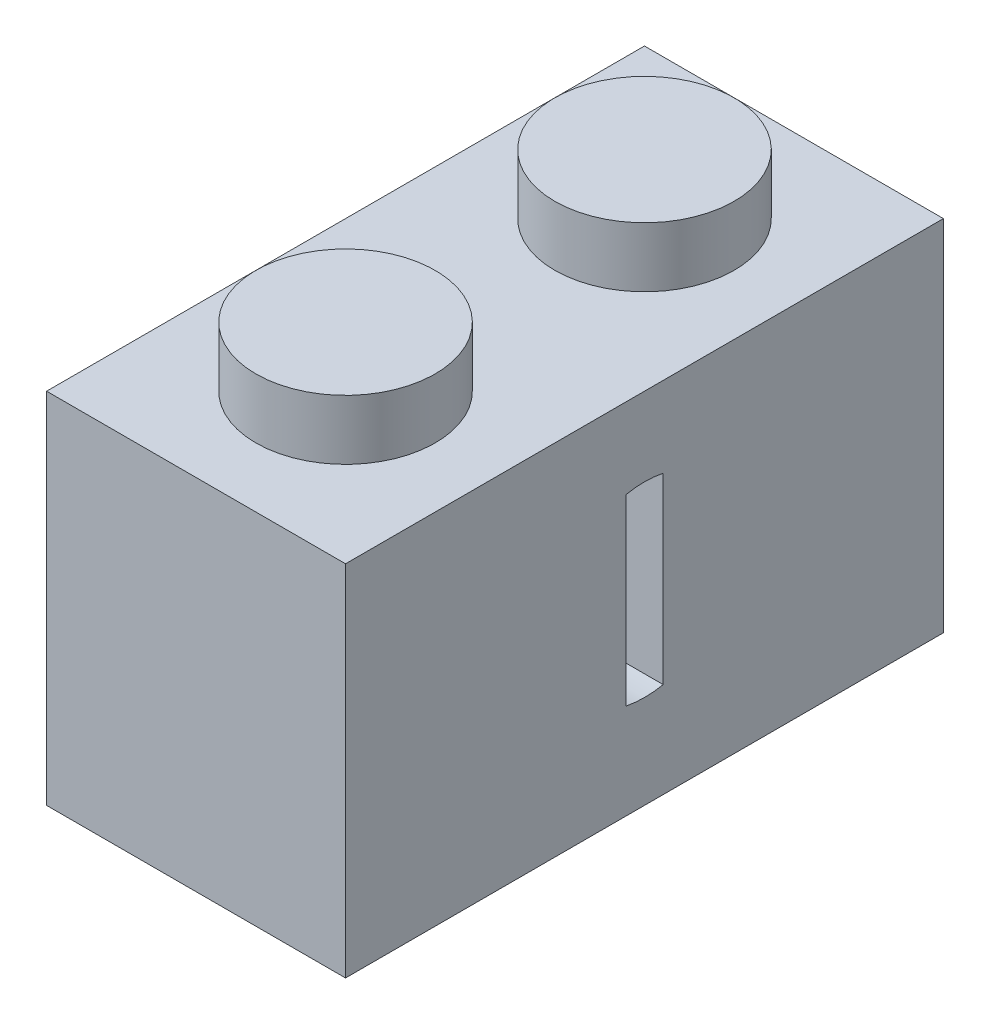
ISO-10303-21;
HEADER;
FILE_DESCRIPTION(('STEP AP214'),'2;1');
FILE_NAME('part.step','',(''),(''),'','','');
FILE_SCHEMA(('AUTOMOTIVE_DESIGN { 1 0 10303 214 1 1 1 1 }'));
ENDSEC;
DATA;
#1=APPLICATION_CONTEXT('core data for automotive mechanical design processes');
#2=APPLICATION_PROTOCOL_DEFINITION('international standard','automotive_design',2000,#1);
#3=PRODUCT_CONTEXT('',#1,'mechanical');
#4=PRODUCT('Part','Part','',(#3));
#5=PRODUCT_RELATED_PRODUCT_CATEGORY('part','',(#4));
#6=PRODUCT_DEFINITION_FORMATION('','',#4);
#7=PRODUCT_DEFINITION_CONTEXT('part definition',#1,'design');
#8=PRODUCT_DEFINITION('design','',#6,#7);
#9=PRODUCT_DEFINITION_SHAPE('','',#8);
#10=(LENGTH_UNIT() NAMED_UNIT(*) SI_UNIT(.MILLI.,.METRE.));
#11=(NAMED_UNIT(*) PLANE_ANGLE_UNIT() SI_UNIT($,.RADIAN.));
#12=(NAMED_UNIT(*) SI_UNIT($,.STERADIAN.) SOLID_ANGLE_UNIT());
#13=UNCERTAINTY_MEASURE_WITH_UNIT(LENGTH_MEASURE(1.E-05),#10,'distance_accuracy_value','');
#14=(GEOMETRIC_REPRESENTATION_CONTEXT(3) GLOBAL_UNCERTAINTY_ASSIGNED_CONTEXT((#13)) GLOBAL_UNIT_ASSIGNED_CONTEXT((#10,
#11,#12)) REPRESENTATION_CONTEXT('',''));
#15=CARTESIAN_POINT('',(0.,0.,0.));
#16=DIRECTION('',(0.,0.,1.));
#17=DIRECTION('',(1.,0.,0.));
#18=AXIS2_PLACEMENT_3D('',#15,#16,#17);
#19=CARTESIAN_POINT('',(3.5,5.,8.));
#20=DIRECTION('',(-1.,0.,0.));
#21=DIRECTION('',(0.,-1.,0.));
#22=AXIS2_PLACEMENT_3D('',#19,#20,#21);
#23=CYLINDRICAL_SURFACE('',#22,2.5);
#24=CARTESIAN_POINT('',(3.5,5.,8.));
#25=DIRECTION('',(-1.,0.,0.));
#26=DIRECTION('',(0.,-1.,0.));
#27=AXIS2_PLACEMENT_3D('',#24,#25,#26);
#28=CIRCLE('',#27,2.5);
#29=CARTESIAN_POINT('',(3.5,2.55051025721683,8.5));
#30=VERTEX_POINT('',#29);
#31=CARTESIAN_POINT('',(3.5,7.44948974278318,8.5));
#32=VERTEX_POINT('',#31);
#33=EDGE_CURVE('E215',#30,#32,#28,.T.);
#34=ORIENTED_EDGE('',*,*,#33,.F.);
#35=DIRECTION('',(-1.,0.,0.));
#36=VECTOR('',#35,1.);
#37=CARTESIAN_POINT('',(13.0990195135928,2.55051025721683,8.5));
#38=LINE('',#37,#36);
#39=CARTESIAN_POINT('',(8.,2.55051025721683,8.5));
#40=VERTEX_POINT('',#39);
#41=EDGE_CURVE('E206',#40,#30,#38,.T.);
#42=ORIENTED_EDGE('',*,*,#41,.F.);
#43=CARTESIAN_POINT('',(8.,5.,8.));
#44=DIRECTION('',(1.,0.,0.));
#45=DIRECTION('',(0.,1.,0.));
#46=AXIS2_PLACEMENT_3D('',#43,#44,#45);
#47=CIRCLE('',#46,2.5);
#48=CARTESIAN_POINT('',(8.,2.55051025721683,7.5));
#49=VERTEX_POINT('',#48);
#50=EDGE_CURVE('E203',#49,#40,#47,.F.);
#51=ORIENTED_EDGE('',*,*,#50,.F.);
#52=DIRECTION('',(-1.,0.,0.));
#53=VECTOR('',#52,1.);
#54=CARTESIAN_POINT('',(13.0990195135928,2.55051025721683,7.5));
#55=LINE('',#54,#53);
#56=CARTESIAN_POINT('',(3.5,2.55051025721683,7.5));
#57=VERTEX_POINT('',#56);
#58=EDGE_CURVE('E207',#49,#57,#55,.T.);
#59=ORIENTED_EDGE('',*,*,#58,.T.);
#60=CARTESIAN_POINT('',(3.5,7.44948974278318,7.5));
#61=VERTEX_POINT('',#60);
#62=EDGE_CURVE('E198',#61,#57,#28,.T.);
#63=ORIENTED_EDGE('',*,*,#62,.F.);
#64=DIRECTION('',(-1.,0.,0.));
#65=VECTOR('',#64,1.);
#66=CARTESIAN_POINT('',(13.0990195135928,7.44948974278318,7.5));
#67=LINE('',#66,#65);
#68=CARTESIAN_POINT('',(8.,7.44948974278318,7.5));
#69=VERTEX_POINT('',#68);
#70=EDGE_CURVE('E60',#69,#61,#67,.T.);
#71=ORIENTED_EDGE('',*,*,#70,.F.);
#72=CARTESIAN_POINT('',(8.,5.,8.));
#73=DIRECTION('',(1.,0.,0.));
#74=DIRECTION('',(0.,1.,0.));
#75=AXIS2_PLACEMENT_3D('',#72,#73,#74);
#76=CIRCLE('',#75,2.5);
#77=CARTESIAN_POINT('',(8.,7.44948974278318,8.5));
#78=VERTEX_POINT('',#77);
#79=EDGE_CURVE('E194',#78,#69,#76,.F.);
#80=ORIENTED_EDGE('',*,*,#79,.F.);
#81=DIRECTION('',(-1.,0.,0.));
#82=VECTOR('',#81,1.);
#83=CARTESIAN_POINT('',(13.0990195135928,7.44948974278318,8.5));
#84=LINE('',#83,#82);
#85=EDGE_CURVE('E199',#78,#32,#84,.T.);
#86=ORIENTED_EDGE('',*,*,#85,.T.);
#87=EDGE_LOOP('',(#34,#42,#51,#59,#63,#71,#80,#86));
#88=FACE_BOUND('',#87,.T.);
#89=DIRECTION('',(-1.,0.,0.));
#90=VECTOR('',#89,1.);
#91=CARTESIAN_POINT('',(3.5,7.25,6.91027526411483));
#92=LINE('',#91,#90);
#93=CARTESIAN_POINT('',(-1.6,7.25,6.91027526411483));
#94=VERTEX_POINT('',#93);
#95=CARTESIAN_POINT('',(0.,7.25,6.91027526411483));
#96=VERTEX_POINT('',#95);
#97=EDGE_CURVE('E160',#94,#96,#92,.F.);
#98=ORIENTED_EDGE('',*,*,#97,.F.);
#99=CARTESIAN_POINT('',(-1.6,5.,8.));
#100=DIRECTION('',(-1.,0.,0.));
#101=DIRECTION('',(0.,-1.,0.));
#102=AXIS2_PLACEMENT_3D('',#99,#100,#101);
#103=CIRCLE('',#102,2.5);
#104=CARTESIAN_POINT('',(-1.6,7.25,9.08972473588517));
#105=VERTEX_POINT('',#104);
#106=EDGE_CURVE('E183',#94,#105,#103,.T.);
#107=ORIENTED_EDGE('',*,*,#106,.T.);
#108=DIRECTION('',(-1.,0.,0.));
#109=VECTOR('',#108,1.);
#110=CARTESIAN_POINT('',(3.5,7.25,9.08972473588517));
#111=LINE('',#110,#109);
#112=CARTESIAN_POINT('',(0.,7.25,9.08972473588517));
#113=VERTEX_POINT('',#112);
#114=EDGE_CURVE('E169',#113,#105,#111,.T.);
#115=ORIENTED_EDGE('',*,*,#114,.F.);
#116=CARTESIAN_POINT('',(0.,5.,8.));
#117=DIRECTION('',(-1.,0.,0.));
#118=DIRECTION('',(0.,-1.,0.));
#119=AXIS2_PLACEMENT_3D('',#116,#117,#118);
#120=CIRCLE('',#119,2.5);
#121=EDGE_CURVE('E168',#96,#113,#120,.F.);
#122=ORIENTED_EDGE('',*,*,#121,.F.);
#123=EDGE_LOOP('',(#98,#107,#115,#122));
#124=FACE_BOUND('',#123,.T.);
#125=ADVANCED_FACE('F37',(#88,#124),#23,.F.);
#126=CARTESIAN_POINT('',(-1.6,5.,8.));
#127=DIRECTION('',(-1.,0.,0.));
#128=DIRECTION('',(0.,-1.,0.));
#129=AXIS2_PLACEMENT_3D('',#126,#127,#128);
#130=PLANE('',#129);
#131=CARTESIAN_POINT('',(-1.6,5.,8.));
#132=DIRECTION('',(-1.,0.,0.));
#133=DIRECTION('',(0.,-1.,0.));
#134=AXIS2_PLACEMENT_3D('',#131,#132,#133);
#135=CIRCLE('',#134,3.25);
#136=CARTESIAN_POINT('',(-1.6,7.25,5.65479212008829));
#137=VERTEX_POINT('',#136);
#138=CARTESIAN_POINT('',(-1.6,7.25,10.3452078799117));
#139=VERTEX_POINT('',#138);
#140=EDGE_CURVE('E185',#137,#139,#135,.T.);
#141=ORIENTED_EDGE('',*,*,#140,.T.);
#142=DIRECTION('',(0.,0.,1.));
#143=VECTOR('',#142,1.);
#144=CARTESIAN_POINT('',(-1.6,7.25,0.));
#145=LINE('',#144,#143);
#146=EDGE_CURVE('E179',#105,#139,#145,.T.);
#147=ORIENTED_EDGE('',*,*,#146,.F.);
#148=ORIENTED_EDGE('',*,*,#106,.F.);
#149=EDGE_CURVE('E163',#137,#94,#145,.T.);
#150=ORIENTED_EDGE('',*,*,#149,.F.);
#151=EDGE_LOOP('',(#141,#147,#148,#150));
#152=FACE_BOUND('',#151,.T.);
#153=ADVANCED_FACE('F307',(#152),#130,.T.);
#154=CARTESIAN_POINT('',(-1.6,5.,8.));
#155=DIRECTION('',(1.,0.,0.));
#156=DIRECTION('',(0.,1.,0.));
#157=AXIS2_PLACEMENT_3D('',#154,#155,#156);
#158=CYLINDRICAL_SURFACE('',#157,3.25);
#159=DIRECTION('',(1.,0.,0.));
#160=VECTOR('',#159,1.);
#161=CARTESIAN_POINT('',(-1.6,7.25,10.3452078799117));
#162=LINE('',#161,#160);
#163=CARTESIAN_POINT('',(0.,7.25,10.3452078799117));
#164=VERTEX_POINT('',#163);
#165=EDGE_CURVE('E12',#139,#164,#162,.T.);
#166=ORIENTED_EDGE('',*,*,#165,.F.);
#167=ORIENTED_EDGE('',*,*,#140,.F.);
#168=DIRECTION('',(1.,0.,0.));
#169=VECTOR('',#168,1.);
#170=CARTESIAN_POINT('',(-1.6,7.25,5.65479212008829));
#171=LINE('',#170,#169);
#172=CARTESIAN_POINT('',(0.,7.25,5.65479212008829));
#173=VERTEX_POINT('',#172);
#174=EDGE_CURVE('E45',#173,#137,#171,.F.);
#175=ORIENTED_EDGE('',*,*,#174,.F.);
#176=CARTESIAN_POINT('',(0.,5.,8.));
#177=DIRECTION('',(1.,0.,0.));
#178=DIRECTION('',(0.,1.,0.));
#179=AXIS2_PLACEMENT_3D('',#176,#177,#178);
#180=CIRCLE('',#179,3.25);
#181=EDGE_CURVE('E178',#173,#164,#180,.F.);
#182=ORIENTED_EDGE('',*,*,#181,.T.);
#183=EDGE_LOOP('',(#166,#167,#175,#182));
#184=FACE_BOUND('',#183,.T.);
#185=ADVANCED_FACE('F311',(#184),#158,.T.);
#186=CARTESIAN_POINT('',(0.,9.6,16.));
#187=DIRECTION('',(1.,0.,0.));
#188=DIRECTION('',(0.,1.,0.));
#189=AXIS2_PLACEMENT_3D('',#186,#187,#188);
#190=PLANE('',#189);
#191=ORIENTED_EDGE('',*,*,#181,.F.);
#192=DIRECTION('',(0.,0.,1.));
#193=VECTOR('',#192,1.);
#194=CARTESIAN_POINT('',(0.,7.25,0.));
#195=LINE('',#194,#193);
#196=EDGE_CURVE('E52',#173,#96,#195,.T.);
#197=ORIENTED_EDGE('',*,*,#196,.T.);
#198=ORIENTED_EDGE('',*,*,#121,.T.);
#199=EDGE_CURVE('E180',#113,#164,#195,.T.);
#200=ORIENTED_EDGE('',*,*,#199,.T.);
#201=EDGE_LOOP('',(#191,#197,#198,#200));
#202=FACE_BOUND('',#201,.T.);
#203=DIRECTION('',(0.,-1.,0.));
#204=VECTOR('',#203,1.);
#205=CARTESIAN_POINT('',(0.,9.6,0.));
#206=LINE('',#205,#204);
#207=CARTESIAN_POINT('',(0.,9.6,0.));
#208=VERTEX_POINT('',#207);
#209=CARTESIAN_POINT('',(0.,0.,0.));
#210=VERTEX_POINT('',#209);
#211=EDGE_CURVE('E278',#208,#210,#206,.T.);
#212=ORIENTED_EDGE('',*,*,#211,.T.);
#213=DIRECTION('',(0.,0.,-1.));
#214=VECTOR('',#213,1.);
#215=CARTESIAN_POINT('',(0.,0.,16.));
#216=LINE('',#215,#214);
#217=CARTESIAN_POINT('',(0.,0.,16.));
#218=VERTEX_POINT('',#217);
#219=EDGE_CURVE('E286',#218,#210,#216,.T.);
#220=ORIENTED_EDGE('',*,*,#219,.F.);
#221=DIRECTION('',(0.,-1.,0.));
#222=VECTOR('',#221,1.);
#223=CARTESIAN_POINT('',(0.,9.6,16.));
#224=LINE('',#223,#222);
#225=CARTESIAN_POINT('',(0.,9.6,16.));
#226=VERTEX_POINT('',#225);
#227=EDGE_CURVE('E284',#226,#218,#224,.T.);
#228=ORIENTED_EDGE('',*,*,#227,.F.);
#229=DIRECTION('',(0.,0.,-1.));
#230=VECTOR('',#229,1.);
#231=CARTESIAN_POINT('',(0.,9.6,16.));
#232=LINE('',#231,#230);
#233=EDGE_CURVE('E298',#226,#208,#232,.T.);
#234=ORIENTED_EDGE('',*,*,#233,.T.);
#235=EDGE_LOOP('',(#212,#220,#228,#234));
#236=FACE_BOUND('',#235,.T.);
#237=ADVANCED_FACE('F173',(#202,#236),#190,.F.);
#238=CARTESIAN_POINT('',(3.5,0.,0.));
#239=DIRECTION('',(-1.,0.,0.));
#240=DIRECTION('',(0.,-1.,0.));
#241=AXIS2_PLACEMENT_3D('',#238,#239,#240);
#242=PLANE('',#241);
#243=ORIENTED_EDGE('',*,*,#33,.T.);
#244=DIRECTION('',(0.,-1.,0.));
#245=VECTOR('',#244,1.);
#246=CARTESIAN_POINT('',(3.5,0.,8.5));
#247=LINE('',#246,#245);
#248=EDGE_CURVE('E195',#32,#30,#247,.T.);
#249=ORIENTED_EDGE('',*,*,#248,.T.);
#250=EDGE_LOOP('',(#243,#249));
#251=FACE_BOUND('',#250,.T.);
#252=ADVANCED_FACE('F374',(#251),#242,.T.);
#253=CARTESIAN_POINT('',(0.,8.,16.));
#254=DIRECTION('',(0.,1.,0.));
#255=DIRECTION('',(0.,0.,1.));
#256=AXIS2_PLACEMENT_3D('',#253,#254,#255);
#257=PLANE('',#256);
#258=DIRECTION('',(1.,0.,0.));
#259=VECTOR('',#258,1.);
#260=CARTESIAN_POINT('',(-7.9524865872714,8.,9.802775637732));
#261=LINE('',#260,#259);
#262=CARTESIAN_POINT('',(1.6,8.,9.802775637732));
#263=VERTEX_POINT('',#262);
#264=CARTESIAN_POINT('',(6.4,8.,9.802775637732));
#265=VERTEX_POINT('',#264);
#266=EDGE_CURVE('E218',#263,#265,#261,.T.);
#267=ORIENTED_EDGE('',*,*,#266,.T.);
#268=DIRECTION('',(0.,0.,1.));
#269=VECTOR('',#268,1.);
#270=CARTESIAN_POINT('',(6.4,8.,1.6));
#271=LINE('',#270,#269);
#272=CARTESIAN_POINT('',(6.4,8.,14.4));
#273=VERTEX_POINT('',#272);
#274=EDGE_CURVE('E268',#265,#273,#271,.T.);
#275=ORIENTED_EDGE('',*,*,#274,.T.);
#276=DIRECTION('',(-1.,0.,0.));
#277=VECTOR('',#276,1.);
#278=CARTESIAN_POINT('',(6.4,8.,14.4));
#279=LINE('',#278,#277);
#280=CARTESIAN_POINT('',(1.6,8.,14.4));
#281=VERTEX_POINT('',#280);
#282=EDGE_CURVE('E260',#273,#281,#279,.T.);
#283=ORIENTED_EDGE('',*,*,#282,.T.);
#284=DIRECTION('',(0.,0.,-1.));
#285=VECTOR('',#284,1.);
#286=CARTESIAN_POINT('',(1.6,8.,14.4));
#287=LINE('',#286,#285);
#288=EDGE_CURVE('E255',#281,#263,#287,.T.);
#289=ORIENTED_EDGE('',*,*,#288,.T.);
#290=EDGE_LOOP('',(#267,#275,#283,#289));
#291=FACE_BOUND('',#290,.T.);
#292=ADVANCED_FACE('F370',(#291),#257,.F.);
#293=DIRECTION('',(1.,0.,0.));
#294=VECTOR('',#293,1.);
#295=CARTESIAN_POINT('',(-7.9524865872714,8.,6.197224362268));
#296=LINE('',#295,#294);
#297=CARTESIAN_POINT('',(1.6,8.,6.197224362268));
#298=VERTEX_POINT('',#297);
#299=CARTESIAN_POINT('',(6.4,8.,6.197224362268));
#300=VERTEX_POINT('',#299);
#301=EDGE_CURVE('E223',#298,#300,#296,.T.);
#302=ORIENTED_EDGE('',*,*,#301,.F.);
#303=CARTESIAN_POINT('',(1.6,8.,1.6));
#304=VERTEX_POINT('',#303);
#305=EDGE_CURVE('E259',#298,#304,#287,.T.);
#306=ORIENTED_EDGE('',*,*,#305,.T.);
#307=DIRECTION('',(1.,0.,0.));
#308=VECTOR('',#307,1.);
#309=CARTESIAN_POINT('',(1.6,8.,1.6));
#310=LINE('',#309,#308);
#311=CARTESIAN_POINT('',(6.4,8.00000000000001,1.6));
#312=VERTEX_POINT('',#311);
#313=EDGE_CURVE('E243',#304,#312,#310,.T.);
#314=ORIENTED_EDGE('',*,*,#313,.T.);
#315=EDGE_CURVE('E265',#312,#300,#271,.T.);
#316=ORIENTED_EDGE('',*,*,#315,.T.);
#317=EDGE_LOOP('',(#302,#306,#314,#316));
#318=FACE_BOUND('',#317,.T.);
#319=ADVANCED_FACE('F373',(#318),#257,.F.);
#320=CARTESIAN_POINT('',(0.,0.,16.));
#321=DIRECTION('',(0.,1.,0.));
#322=DIRECTION('',(0.,0.,1.));
#323=AXIS2_PLACEMENT_3D('',#320,#321,#322);
#324=PLANE('',#323);
#325=DIRECTION('',(0.,0.,1.));
#326=VECTOR('',#325,1.);
#327=CARTESIAN_POINT('',(6.4,0.,1.6));
#328=LINE('',#327,#326);
#329=CARTESIAN_POINT('',(6.4,0.,1.6));
#330=VERTEX_POINT('',#329);
#331=CARTESIAN_POINT('',(6.4,0.,14.4));
#332=VERTEX_POINT('',#331);
#333=EDGE_CURVE('E244',#330,#332,#328,.T.);
#334=ORIENTED_EDGE('',*,*,#333,.F.);
#335=DIRECTION('',(1.,0.,0.));
#336=VECTOR('',#335,1.);
#337=CARTESIAN_POINT('',(1.6,0.,1.6));
#338=LINE('',#337,#336);
#339=CARTESIAN_POINT('',(1.6,0.,1.6));
#340=VERTEX_POINT('',#339);
#341=EDGE_CURVE('E247',#340,#330,#338,.T.);
#342=ORIENTED_EDGE('',*,*,#341,.F.);
#343=DIRECTION('',(0.,0.,-1.));
#344=VECTOR('',#343,1.);
#345=CARTESIAN_POINT('',(1.6,0.,14.4));
#346=LINE('',#345,#344);
#347=CARTESIAN_POINT('',(1.6,0.,14.4));
#348=VERTEX_POINT('',#347);
#349=EDGE_CURVE('E238',#348,#340,#346,.T.);
#350=ORIENTED_EDGE('',*,*,#349,.F.);
#351=DIRECTION('',(-1.,0.,0.));
#352=VECTOR('',#351,1.);
#353=CARTESIAN_POINT('',(6.4,0.,14.4));
#354=LINE('',#353,#352);
#355=EDGE_CURVE('E241',#332,#348,#354,.T.);
#356=ORIENTED_EDGE('',*,*,#355,.F.);
#357=EDGE_LOOP('',(#334,#342,#350,#356));
#358=FACE_BOUND('',#357,.T.);
#359=DIRECTION('',(1.,0.,0.));
#360=VECTOR('',#359,1.);
#361=CARTESIAN_POINT('',(0.,0.,0.));
#362=LINE('',#361,#360);
#363=CARTESIAN_POINT('',(8.,0.,0.));
#364=VERTEX_POINT('',#363);
#365=EDGE_CURVE('E274',#210,#364,#362,.T.);
#366=ORIENTED_EDGE('',*,*,#365,.T.);
#367=DIRECTION('',(0.,0.,-1.));
#368=VECTOR('',#367,1.);
#369=CARTESIAN_POINT('',(8.,0.,16.));
#370=LINE('',#369,#368);
#371=CARTESIAN_POINT('',(8.,0.,16.));
#372=VERTEX_POINT('',#371);
#373=EDGE_CURVE('E302',#372,#364,#370,.T.);
#374=ORIENTED_EDGE('',*,*,#373,.F.);
#375=DIRECTION('',(1.,0.,0.));
#376=VECTOR('',#375,1.);
#377=CARTESIAN_POINT('',(0.,0.,16.));
#378=LINE('',#377,#376);
#379=EDGE_CURVE('E275',#218,#372,#378,.T.);
#380=ORIENTED_EDGE('',*,*,#379,.F.);
#381=ORIENTED_EDGE('',*,*,#219,.T.);
#382=EDGE_LOOP('',(#366,#374,#380,#381));
#383=FACE_BOUND('',#382,.T.);
#384=ADVANCED_FACE('F39',(#358,#383),#324,.F.);
#385=CARTESIAN_POINT('',(8.,9.6,16.));
#386=DIRECTION('',(1.,0.,0.));
#387=DIRECTION('',(0.,1.,0.));
#388=AXIS2_PLACEMENT_3D('',#385,#386,#387);
#389=PLANE('',#388);
#390=ORIENTED_EDGE('',*,*,#79,.T.);
#391=DIRECTION('',(0.,-1.,0.));
#392=VECTOR('',#391,1.);
#393=CARTESIAN_POINT('',(8.,0.,7.5));
#394=LINE('',#393,#392);
#395=EDGE_CURVE('E208',#69,#49,#394,.T.);
#396=ORIENTED_EDGE('',*,*,#395,.T.);
#397=ORIENTED_EDGE('',*,*,#50,.T.);
#398=DIRECTION('',(0.,-1.,0.));
#399=VECTOR('',#398,1.);
#400=CARTESIAN_POINT('',(8.,0.,8.5));
#401=LINE('',#400,#399);
#402=EDGE_CURVE('E191',#78,#40,#401,.T.);
#403=ORIENTED_EDGE('',*,*,#402,.F.);
#404=EDGE_LOOP('',(#390,#396,#397,#403));
#405=FACE_BOUND('',#404,.T.);
#406=DIRECTION('',(0.,-1.,0.));
#407=VECTOR('',#406,1.);
#408=CARTESIAN_POINT('',(8.,9.6,0.));
#409=LINE('',#408,#407);
#410=CARTESIAN_POINT('',(8.,9.6,0.));
#411=VERTEX_POINT('',#410);
#412=EDGE_CURVE('E289',#411,#364,#409,.T.);
#413=ORIENTED_EDGE('',*,*,#412,.F.);
#414=DIRECTION('',(0.,0.,-1.));
#415=VECTOR('',#414,1.);
#416=CARTESIAN_POINT('',(8.,9.6,16.));
#417=LINE('',#416,#415);
#418=CARTESIAN_POINT('',(8.,9.6,16.));
#419=VERTEX_POINT('',#418);
#420=EDGE_CURVE('E300',#419,#411,#417,.T.);
#421=ORIENTED_EDGE('',*,*,#420,.F.);
#422=DIRECTION('',(0.,-1.,0.));
#423=VECTOR('',#422,1.);
#424=CARTESIAN_POINT('',(8.,9.6,16.));
#425=LINE('',#424,#423);
#426=EDGE_CURVE('E277',#419,#372,#425,.T.);
#427=ORIENTED_EDGE('',*,*,#426,.T.);
#428=ORIENTED_EDGE('',*,*,#373,.T.);
#429=EDGE_LOOP('',(#413,#421,#427,#428));
#430=FACE_BOUND('',#429,.T.);
#431=ADVANCED_FACE('F387',(#405,#430),#389,.T.);
#432=CARTESIAN_POINT('',(0.,9.6,16.));
#433=DIRECTION('',(0.,1.,0.));
#434=DIRECTION('',(0.,0.,1.));
#435=AXIS2_PLACEMENT_3D('',#432,#433,#434);
#436=PLANE('',#435);
#437=CARTESIAN_POINT('',(4.,9.6,4.));
#438=DIRECTION('',(0.,1.,0.));
#439=DIRECTION('',(0.,0.,1.));
#440=AXIS2_PLACEMENT_3D('',#437,#438,#439);
#441=CIRCLE('',#440,2.4);
#442=CARTESIAN_POINT('',(4.,9.6,6.4));
#443=VERTEX_POINT('',#442);
#444=EDGE_CURVE('E229',#443,#443,#441,.T.);
#445=ORIENTED_EDGE('',*,*,#444,.F.);
#446=EDGE_LOOP('',(#445));
#447=FACE_BOUND('',#446,.T.);
#448=CARTESIAN_POINT('',(4.,9.6,12.));
#449=DIRECTION('',(0.,1.,0.));
#450=DIRECTION('',(0.,0.,1.));
#451=AXIS2_PLACEMENT_3D('',#448,#449,#450);
#452=CIRCLE('',#451,2.4);
#453=CARTESIAN_POINT('',(4.,9.6,14.4));
#454=VERTEX_POINT('',#453);
#455=EDGE_CURVE('E232',#454,#454,#452,.T.);
#456=ORIENTED_EDGE('',*,*,#455,.F.);
#457=EDGE_LOOP('',(#456));
#458=FACE_BOUND('',#457,.T.);
#459=DIRECTION('',(1.,0.,0.));
#460=VECTOR('',#459,1.);
#461=CARTESIAN_POINT('',(0.,9.6,0.));
#462=LINE('',#461,#460);
#463=EDGE_CURVE('E292',#208,#411,#462,.T.);
#464=ORIENTED_EDGE('',*,*,#463,.F.);
#465=ORIENTED_EDGE('',*,*,#233,.F.);
#466=DIRECTION('',(1.,0.,0.));
#467=VECTOR('',#466,1.);
#468=CARTESIAN_POINT('',(0.,9.6,16.));
#469=LINE('',#468,#467);
#470=EDGE_CURVE('E281',#226,#419,#469,.T.);
#471=ORIENTED_EDGE('',*,*,#470,.T.);
#472=ORIENTED_EDGE('',*,*,#420,.T.);
#473=EDGE_LOOP('',(#464,#465,#471,#472));
#474=FACE_BOUND('',#473,.T.);
#475=ADVANCED_FACE('F379',(#447,#458,#474),#436,.T.);
#476=CARTESIAN_POINT('',(0.,0.,16.));
#477=DIRECTION('',(0.,0.,-1.));
#478=DIRECTION('',(-1.,0.,0.));
#479=AXIS2_PLACEMENT_3D('',#476,#477,#478);
#480=PLANE('',#479);
#481=ORIENTED_EDGE('',*,*,#379,.T.);
#482=ORIENTED_EDGE('',*,*,#426,.F.);
#483=ORIENTED_EDGE('',*,*,#470,.F.);
#484=ORIENTED_EDGE('',*,*,#227,.T.);
#485=EDGE_LOOP('',(#481,#482,#483,#484));
#486=FACE_BOUND('',#485,.T.);
#487=ADVANCED_FACE('F376',(#486),#480,.F.);
#488=CARTESIAN_POINT('',(0.,0.,0.));
#489=DIRECTION('',(0.,0.,-1.));
#490=DIRECTION('',(-1.,0.,0.));
#491=AXIS2_PLACEMENT_3D('',#488,#489,#490);
#492=PLANE('',#491);
#493=ORIENTED_EDGE('',*,*,#365,.F.);
#494=ORIENTED_EDGE('',*,*,#211,.F.);
#495=ORIENTED_EDGE('',*,*,#463,.T.);
#496=ORIENTED_EDGE('',*,*,#412,.T.);
#497=EDGE_LOOP('',(#493,#494,#495,#496));
#498=FACE_BOUND('',#497,.T.);
#499=ADVANCED_FACE('F368',(#498),#492,.T.);
#500=CARTESIAN_POINT('',(1.6,29.670405992508,1.6));
#501=DIRECTION('',(0.,0.,-1.));
#502=DIRECTION('',(-1.,0.,0.));
#503=AXIS2_PLACEMENT_3D('',#500,#501,#502);
#504=PLANE('',#503);
#505=DIRECTION('',(0.,-1.,0.));
#506=VECTOR('',#505,1.);
#507=CARTESIAN_POINT('',(1.6,29.670405992508,1.6));
#508=LINE('',#507,#506);
#509=EDGE_CURVE('E258',#304,#340,#508,.T.);
#510=ORIENTED_EDGE('',*,*,#509,.T.);
#511=ORIENTED_EDGE('',*,*,#341,.T.);
#512=DIRECTION('',(0.,-1.,0.));
#513=VECTOR('',#512,1.);
#514=CARTESIAN_POINT('',(6.4,29.670405992508,1.6));
#515=LINE('',#514,#513);
#516=EDGE_CURVE('E254',#312,#330,#515,.T.);
#517=ORIENTED_EDGE('',*,*,#516,.F.);
#518=ORIENTED_EDGE('',*,*,#313,.F.);
#519=EDGE_LOOP('',(#510,#511,#517,#518));
#520=FACE_BOUND('',#519,.T.);
#521=ADVANCED_FACE('F364',(#520),#504,.F.);
#522=CARTESIAN_POINT('',(6.4,29.670405992508,1.6));
#523=DIRECTION('',(1.,0.,0.));
#524=DIRECTION('',(0.,0.,-1.));
#525=AXIS2_PLACEMENT_3D('',#522,#523,#524);
#526=PLANE('',#525);
#527=CARTESIAN_POINT('',(6.4,5.,8.));
#528=DIRECTION('',(-1.,0.,0.));
#529=DIRECTION('',(0.,0.,1.));
#530=AXIS2_PLACEMENT_3D('',#527,#528,#529);
#531=CIRCLE('',#530,3.5);
#532=EDGE_CURVE('E219',#300,#265,#531,.T.);
#533=ORIENTED_EDGE('',*,*,#532,.F.);
#534=ORIENTED_EDGE('',*,*,#315,.F.);
#535=ORIENTED_EDGE('',*,*,#516,.T.);
#536=ORIENTED_EDGE('',*,*,#333,.T.);
#537=DIRECTION('',(0.,-1.,0.));
#538=VECTOR('',#537,1.);
#539=CARTESIAN_POINT('',(6.4,29.670405992508,14.4));
#540=LINE('',#539,#538);
#541=EDGE_CURVE('E264',#273,#332,#540,.T.);
#542=ORIENTED_EDGE('',*,*,#541,.F.);
#543=ORIENTED_EDGE('',*,*,#274,.F.);
#544=EDGE_LOOP('',(#533,#534,#535,#536,#542,#543));
#545=FACE_BOUND('',#544,.T.);
#546=ADVANCED_FACE('F360',(#545),#526,.F.);
#547=CARTESIAN_POINT('',(6.4,29.670405992508,14.4));
#548=DIRECTION('',(0.,0.,1.));
#549=DIRECTION('',(1.,0.,0.));
#550=AXIS2_PLACEMENT_3D('',#547,#548,#549);
#551=PLANE('',#550);
#552=ORIENTED_EDGE('',*,*,#541,.T.);
#553=ORIENTED_EDGE('',*,*,#355,.T.);
#554=DIRECTION('',(0.,-1.,0.));
#555=VECTOR('',#554,1.);
#556=CARTESIAN_POINT('',(1.6,29.670405992508,14.4));
#557=LINE('',#556,#555);
#558=EDGE_CURVE('E263',#281,#348,#557,.T.);
#559=ORIENTED_EDGE('',*,*,#558,.F.);
#560=ORIENTED_EDGE('',*,*,#282,.F.);
#561=EDGE_LOOP('',(#552,#553,#559,#560));
#562=FACE_BOUND('',#561,.T.);
#563=ADVANCED_FACE('F356',(#562),#551,.F.);
#564=CARTESIAN_POINT('',(1.6,29.670405992508,14.4));
#565=DIRECTION('',(-1.,0.,0.));
#566=DIRECTION('',(0.,0.,1.));
#567=AXIS2_PLACEMENT_3D('',#564,#565,#566);
#568=PLANE('',#567);
#569=CARTESIAN_POINT('',(1.6,5.,8.));
#570=DIRECTION('',(-1.,0.,0.));
#571=DIRECTION('',(0.,0.,1.));
#572=AXIS2_PLACEMENT_3D('',#569,#570,#571);
#573=CIRCLE('',#572,3.5);
#574=EDGE_CURVE('E222',#298,#263,#573,.T.);
#575=ORIENTED_EDGE('',*,*,#574,.T.);
#576=ORIENTED_EDGE('',*,*,#288,.F.);
#577=ORIENTED_EDGE('',*,*,#558,.T.);
#578=ORIENTED_EDGE('',*,*,#349,.T.);
#579=ORIENTED_EDGE('',*,*,#509,.F.);
#580=ORIENTED_EDGE('',*,*,#305,.F.);
#581=EDGE_LOOP('',(#575,#576,#577,#578,#579,#580));
#582=FACE_BOUND('',#581,.T.);
#583=ADVANCED_FACE('F352',(#582),#568,.F.);
#584=CARTESIAN_POINT('',(4.,11.2,12.));
#585=DIRECTION('',(0.,-1.,0.));
#586=DIRECTION('',(0.,0.,-1.));
#587=AXIS2_PLACEMENT_3D('',#584,#585,#586);
#588=CYLINDRICAL_SURFACE('',#587,2.4);
#589=CARTESIAN_POINT('',(4.,11.2,12.));
#590=DIRECTION('',(0.,1.,0.));
#591=DIRECTION('',(0.,0.,1.));
#592=AXIS2_PLACEMENT_3D('',#589,#590,#591);
#593=CIRCLE('',#592,2.4);
#594=CARTESIAN_POINT('',(4.,11.2,14.4));
#595=VERTEX_POINT('',#594);
#596=EDGE_CURVE('E235',#595,#595,#593,.T.);
#597=ORIENTED_EDGE('',*,*,#596,.F.);
#598=EDGE_LOOP('',(#597));
#599=FACE_BOUND('',#598,.T.);
#600=ORIENTED_EDGE('',*,*,#455,.T.);
#601=EDGE_LOOP('',(#600));
#602=FACE_BOUND('',#601,.T.);
#603=ADVANCED_FACE('F348',(#599,#602),#588,.T.);
#604=CARTESIAN_POINT('',(4.,11.2,12.));
#605=DIRECTION('',(0.,1.,0.));
#606=DIRECTION('',(0.,0.,1.));
#607=AXIS2_PLACEMENT_3D('',#604,#605,#606);
#608=PLANE('',#607);
#609=ORIENTED_EDGE('',*,*,#596,.T.);
#610=EDGE_LOOP('',(#609));
#611=FACE_BOUND('',#610,.T.);
#612=ADVANCED_FACE('F341',(#611),#608,.T.);
#613=CARTESIAN_POINT('',(4.,11.2,4.));
#614=DIRECTION('',(0.,-1.,0.));
#615=DIRECTION('',(0.,0.,-1.));
#616=AXIS2_PLACEMENT_3D('',#613,#614,#615);
#617=CYLINDRICAL_SURFACE('',#616,2.4);
#618=CARTESIAN_POINT('',(4.,11.2,4.));
#619=DIRECTION('',(0.,1.,0.));
#620=DIRECTION('',(0.,0.,1.));
#621=AXIS2_PLACEMENT_3D('',#618,#619,#620);
#622=CIRCLE('',#621,2.4);
#623=CARTESIAN_POINT('',(4.,11.2,6.4));
#624=VERTEX_POINT('',#623);
#625=EDGE_CURVE('E225',#624,#624,#622,.T.);
#626=ORIENTED_EDGE('',*,*,#625,.F.);
#627=EDGE_LOOP('',(#626));
#628=FACE_BOUND('',#627,.T.);
#629=ORIENTED_EDGE('',*,*,#444,.T.);
#630=EDGE_LOOP('',(#629));
#631=FACE_BOUND('',#630,.T.);
#632=ADVANCED_FACE('F338',(#628,#631),#617,.T.);
#633=CARTESIAN_POINT('',(4.,11.2,4.));
#634=DIRECTION('',(0.,1.,0.));
#635=DIRECTION('',(0.,0.,1.));
#636=AXIS2_PLACEMENT_3D('',#633,#634,#635);
#637=PLANE('',#636);
#638=ORIENTED_EDGE('',*,*,#625,.T.);
#639=EDGE_LOOP('',(#638));
#640=FACE_BOUND('',#639,.T.);
#641=ADVANCED_FACE('F336',(#640),#637,.T.);
#642=CARTESIAN_POINT('',(-7.9524865872714,5.,8.));
#643=DIRECTION('',(1.,0.,0.));
#644=DIRECTION('',(0.,0.,-1.));
#645=AXIS2_PLACEMENT_3D('',#642,#643,#644);
#646=CYLINDRICAL_SURFACE('',#645,3.5);
#647=ORIENTED_EDGE('',*,*,#574,.F.);
#648=ORIENTED_EDGE('',*,*,#301,.T.);
#649=ORIENTED_EDGE('',*,*,#532,.T.);
#650=ORIENTED_EDGE('',*,*,#266,.F.);
#651=EDGE_LOOP('',(#647,#648,#649,#650));
#652=FACE_BOUND('',#651,.T.);
#653=ADVANCED_FACE('F333',(#652),#646,.T.);
#654=DIRECTION('',(0.,-1.,0.));
#655=VECTOR('',#654,1.);
#656=CARTESIAN_POINT('',(3.5,0.,7.5));
#657=LINE('',#656,#655);
#658=EDGE_CURVE('E192',#61,#57,#657,.T.);
#659=ORIENTED_EDGE('',*,*,#658,.F.);
#660=ORIENTED_EDGE('',*,*,#62,.T.);
#661=EDGE_LOOP('',(#659,#660));
#662=FACE_BOUND('',#661,.T.);
#663=ADVANCED_FACE('F331',(#662),#242,.T.);
#664=CARTESIAN_POINT('',(13.0990195135928,0.,7.5));
#665=DIRECTION('',(0.,0.,-1.));
#666=DIRECTION('',(-1.,0.,0.));
#667=AXIS2_PLACEMENT_3D('',#664,#665,#666);
#668=PLANE('',#667);
#669=ORIENTED_EDGE('',*,*,#70,.T.);
#670=ORIENTED_EDGE('',*,*,#658,.T.);
#671=ORIENTED_EDGE('',*,*,#58,.F.);
#672=ORIENTED_EDGE('',*,*,#395,.F.);
#673=EDGE_LOOP('',(#669,#670,#671,#672));
#674=FACE_BOUND('',#673,.T.);
#675=ADVANCED_FACE('F415',(#674),#668,.F.);
#676=CARTESIAN_POINT('',(13.0990195135928,0.,8.5));
#677=DIRECTION('',(0.,0.,-1.));
#678=DIRECTION('',(-1.,0.,0.));
#679=AXIS2_PLACEMENT_3D('',#676,#677,#678);
#680=PLANE('',#679);
#681=ORIENTED_EDGE('',*,*,#402,.T.);
#682=ORIENTED_EDGE('',*,*,#41,.T.);
#683=ORIENTED_EDGE('',*,*,#248,.F.);
#684=ORIENTED_EDGE('',*,*,#85,.F.);
#685=EDGE_LOOP('',(#681,#682,#683,#684));
#686=FACE_BOUND('',#685,.T.);
#687=ADVANCED_FACE('F319',(#686),#680,.T.);
#688=CARTESIAN_POINT('',(0.,7.25,0.));
#689=DIRECTION('',(0.,1.,0.));
#690=DIRECTION('',(0.,0.,1.));
#691=AXIS2_PLACEMENT_3D('',#688,#689,#690);
#692=PLANE('',#691);
#693=ORIENTED_EDGE('',*,*,#97,.T.);
#694=ORIENTED_EDGE('',*,*,#196,.F.);
#695=ORIENTED_EDGE('',*,*,#174,.T.);
#696=ORIENTED_EDGE('',*,*,#149,.T.);
#697=EDGE_LOOP('',(#693,#694,#695,#696));
#698=FACE_BOUND('',#697,.T.);
#699=ADVANCED_FACE('F161',(#698),#692,.T.);
#700=ORIENTED_EDGE('',*,*,#114,.T.);
#701=ORIENTED_EDGE('',*,*,#146,.T.);
#702=ORIENTED_EDGE('',*,*,#165,.T.);
#703=ORIENTED_EDGE('',*,*,#199,.F.);
#704=EDGE_LOOP('',(#700,#701,#702,#703));
#705=FACE_BOUND('',#704,.T.);
#706=ADVANCED_FACE('F313',(#705),#692,.T.);
#707=CLOSED_SHELL('',(#125,#153,#185,#237,#252,#292,#319,#384,#431,#475,#487,#499,#521,#546,
#563,#583,#603,#612,#632,#641,#653,#663,#675,#687,#699,#706));
#708=MANIFOLD_SOLID_BREP('B2',#707);
#709=ADVANCED_BREP_SHAPE_REPRESENTATION('',(#18,#708),#14);
#710=SHAPE_DEFINITION_REPRESENTATION(#9,#709);
ENDSEC;
END-ISO-10303-21;
